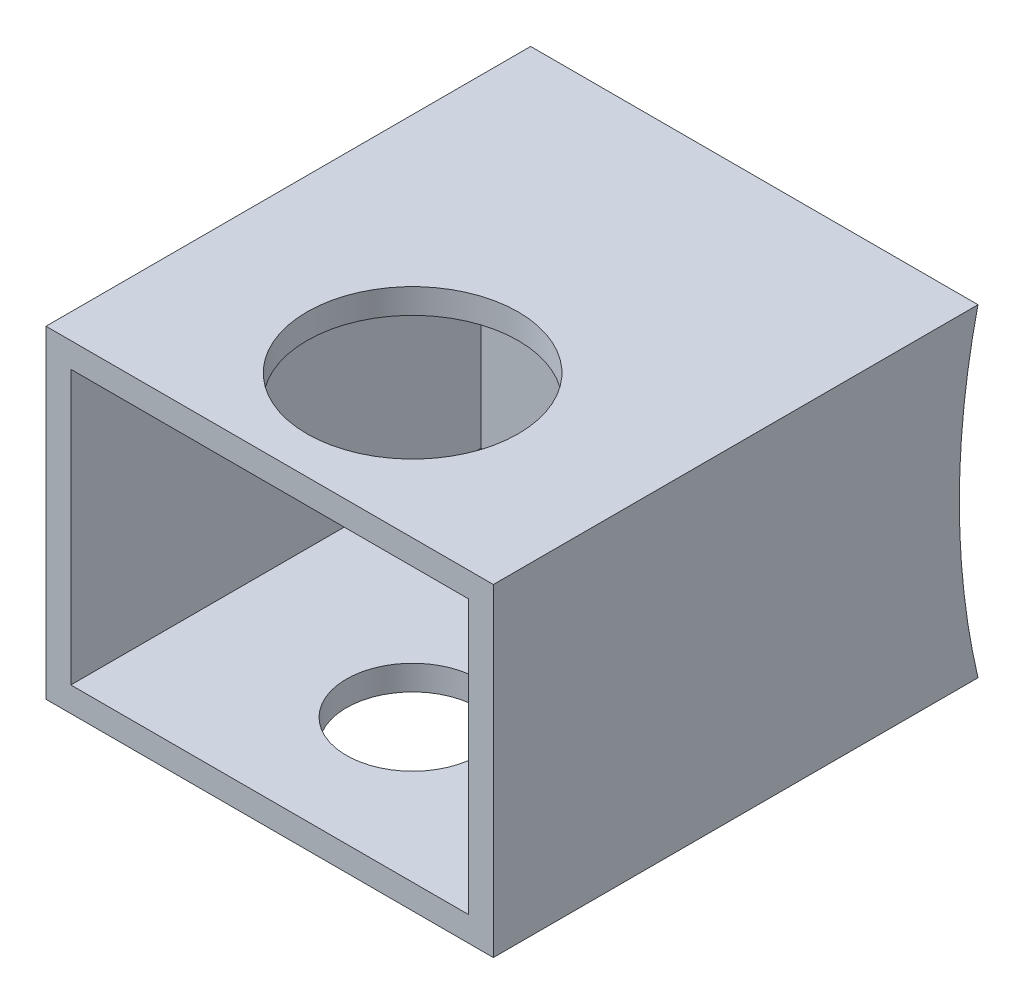
ISO-10303-21;
HEADER;
FILE_DESCRIPTION(('STEP AP214'),'2;1');
FILE_NAME('part.step','',(''),(''),'','','');
FILE_SCHEMA(('AUTOMOTIVE_DESIGN { 1 0 10303 214 1 1 1 1 }'));
ENDSEC;
DATA;
#1=APPLICATION_CONTEXT('core data for automotive mechanical design processes');
#2=APPLICATION_PROTOCOL_DEFINITION('international standard','automotive_design',2000,#1);
#3=PRODUCT_CONTEXT('',#1,'mechanical');
#4=PRODUCT('Part','Part','',(#3));
#5=PRODUCT_RELATED_PRODUCT_CATEGORY('part','',(#4));
#6=PRODUCT_DEFINITION_FORMATION('','',#4);
#7=PRODUCT_DEFINITION_CONTEXT('part definition',#1,'design');
#8=PRODUCT_DEFINITION('design','',#6,#7);
#9=PRODUCT_DEFINITION_SHAPE('','',#8);
#10=(LENGTH_UNIT() NAMED_UNIT(*) SI_UNIT(.MILLI.,.METRE.));
#11=(NAMED_UNIT(*) PLANE_ANGLE_UNIT() SI_UNIT($,.RADIAN.));
#12=(NAMED_UNIT(*) SI_UNIT($,.STERADIAN.) SOLID_ANGLE_UNIT());
#13=UNCERTAINTY_MEASURE_WITH_UNIT(LENGTH_MEASURE(1.E-05),#10,'distance_accuracy_value','');
#14=(GEOMETRIC_REPRESENTATION_CONTEXT(3) GLOBAL_UNCERTAINTY_ASSIGNED_CONTEXT((#13)) GLOBAL_UNIT_ASSIGNED_CONTEXT((#10,
#11,#12)) REPRESENTATION_CONTEXT('',''));
#15=CARTESIAN_POINT('',(0.,0.,0.));
#16=DIRECTION('',(0.,0.,1.));
#17=DIRECTION('',(1.,0.,0.));
#18=AXIS2_PLACEMENT_3D('',#15,#16,#17);
#19=CARTESIAN_POINT('',(1.30440796139928,5.04280714285714,9.906));
#20=DIRECTION('',(0.,-1.,0.));
#21=DIRECTION('',(1.,0.,0.));
#22=AXIS2_PLACEMENT_3D('',#19,#20,#21);
#23=PLANE('',#22);
#24=CARTESIAN_POINT('',(-3.26759203860072,5.04280714285714,6.985));
#25=DIRECTION('',(0.,1.,0.));
#26=DIRECTION('',(-1.,0.,0.));
#27=AXIS2_PLACEMENT_3D('',#24,#25,#26);
#28=CIRCLE('',#27,2.159);
#29=CARTESIAN_POINT('',(-5.42659203860072,5.04280714285714,6.985));
#30=VERTEX_POINT('',#29);
#31=EDGE_CURVE('E197',#30,#30,#28,.T.);
#32=ORIENTED_EDGE('',*,*,#31,.F.);
#33=EDGE_LOOP('',(#32));
#34=FACE_BOUND('',#33,.T.);
#35=DIRECTION('',(-1.,0.,0.));
#36=VECTOR('',#35,1.);
#37=CARTESIAN_POINT('',(1.30440796139928,5.04280714285714,0.));
#38=LINE('',#37,#36);
#39=CARTESIAN_POINT('',(1.30440796139928,5.04280714285714,0.));
#40=VERTEX_POINT('',#39);
#41=CARTESIAN_POINT('',(-7.83959203860072,5.04280714285714,0.));
#42=VERTEX_POINT('',#41);
#43=EDGE_CURVE('E133',#40,#42,#38,.T.);
#44=ORIENTED_EDGE('',*,*,#43,.T.);
#45=DIRECTION('',(0.,0.,-1.));
#46=VECTOR('',#45,1.);
#47=CARTESIAN_POINT('',(-7.83959203860072,5.04280714285714,9.906));
#48=LINE('',#47,#46);
#49=CARTESIAN_POINT('',(-7.83959203860072,5.04280714285714,9.906));
#50=VERTEX_POINT('',#49);
#51=EDGE_CURVE('E11',#50,#42,#48,.T.);
#52=ORIENTED_EDGE('',*,*,#51,.F.);
#53=DIRECTION('',(-1.,0.,0.));
#54=VECTOR('',#53,1.);
#55=CARTESIAN_POINT('',(1.30440796139928,5.04280714285714,9.906));
#56=LINE('',#55,#54);
#57=CARTESIAN_POINT('',(1.30440796139928,5.04280714285714,9.906));
#58=VERTEX_POINT('',#57);
#59=EDGE_CURVE('E110',#58,#50,#56,.T.);
#60=ORIENTED_EDGE('',*,*,#59,.F.);
#61=DIRECTION('',(0.,0.,-1.));
#62=VECTOR('',#61,1.);
#63=CARTESIAN_POINT('',(1.30440796139928,5.04280714285714,9.906));
#64=LINE('',#63,#62);
#65=EDGE_CURVE('E129',#58,#40,#64,.T.);
#66=ORIENTED_EDGE('',*,*,#65,.T.);
#67=EDGE_LOOP('',(#44,#52,#60,#66));
#68=FACE_BOUND('',#67,.T.);
#69=ADVANCED_FACE('F39',(#34,#68),#23,.F.);
#70=CARTESIAN_POINT('',(-7.83959203860072,5.04280714285714,9.906));
#71=DIRECTION('',(1.,0.,0.));
#72=DIRECTION('',(0.,1.,0.));
#73=AXIS2_PLACEMENT_3D('',#70,#71,#72);
#74=PLANE('',#73);
#75=ORIENTED_EDGE('',*,*,#51,.T.);
#76=CARTESIAN_POINT('',(-7.83959203860072,1.74080714285714,-14.0964279163198));
#77=DIRECTION('',(-1.,0.,0.));
#78=DIRECTION('',(0.,0.,1.));
#79=AXIS2_PLACEMENT_3D('',#76,#77,#78);
#80=CIRCLE('',#79,14.478);
#81=CARTESIAN_POINT('',(-7.83959203860072,-1.56119285714286,0.));
#82=VERTEX_POINT('',#81);
#83=EDGE_CURVE('E120',#82,#42,#80,.T.);
#84=ORIENTED_EDGE('',*,*,#83,.F.);
#85=DIRECTION('',(0.,0.,-1.));
#86=VECTOR('',#85,1.);
#87=CARTESIAN_POINT('',(-7.83959203860072,-1.56119285714286,9.906));
#88=LINE('',#87,#86);
#89=CARTESIAN_POINT('',(-7.83959203860072,-1.56119285714286,9.906));
#90=VERTEX_POINT('',#89);
#91=EDGE_CURVE('E47',#90,#82,#88,.T.);
#92=ORIENTED_EDGE('',*,*,#91,.F.);
#93=DIRECTION('',(0.,-1.,0.));
#94=VECTOR('',#93,1.);
#95=CARTESIAN_POINT('',(-7.83959203860072,5.04280714285714,9.906));
#96=LINE('',#95,#94);
#97=EDGE_CURVE('E103',#50,#90,#96,.T.);
#98=ORIENTED_EDGE('',*,*,#97,.F.);
#99=EDGE_LOOP('',(#75,#84,#92,#98));
#100=FACE_BOUND('',#99,.T.);
#101=ADVANCED_FACE('F117',(#100),#74,.F.);
#102=CARTESIAN_POINT('',(-7.83959203860072,-1.56119285714286,9.906));
#103=DIRECTION('',(0.,1.,0.));
#104=DIRECTION('',(0.,0.,1.));
#105=AXIS2_PLACEMENT_3D('',#102,#103,#104);
#106=PLANE('',#105);
#107=CARTESIAN_POINT('',(-3.26759203860072,-1.56119285714286,6.985));
#108=DIRECTION('',(0.,-1.,0.));
#109=DIRECTION('',(0.,0.,-1.));
#110=AXIS2_PLACEMENT_3D('',#107,#108,#109);
#111=CIRCLE('',#110,1.35254999999999);
#112=CARTESIAN_POINT('',(-3.26759203860072,-1.56119285714286,5.63245000000001));
#113=VERTEX_POINT('',#112);
#114=EDGE_CURVE('E205',#113,#113,#111,.T.);
#115=ORIENTED_EDGE('',*,*,#114,.F.);
#116=EDGE_LOOP('',(#115));
#117=FACE_BOUND('',#116,.T.);
#118=DIRECTION('',(1.,0.,0.));
#119=VECTOR('',#118,1.);
#120=CARTESIAN_POINT('',(-7.83959203860072,-1.56119285714286,0.));
#121=LINE('',#120,#119);
#122=CARTESIAN_POINT('',(1.30440796139928,-1.56119285714286,0.));
#123=VERTEX_POINT('',#122);
#124=EDGE_CURVE('E137',#82,#123,#121,.T.);
#125=ORIENTED_EDGE('',*,*,#124,.T.);
#126=DIRECTION('',(0.,0.,-1.));
#127=VECTOR('',#126,1.);
#128=CARTESIAN_POINT('',(1.30440796139928,-1.56119285714286,9.906));
#129=LINE('',#128,#127);
#130=CARTESIAN_POINT('',(1.30440796139928,-1.56119285714286,9.906));
#131=VERTEX_POINT('',#130);
#132=EDGE_CURVE('E123',#131,#123,#129,.T.);
#133=ORIENTED_EDGE('',*,*,#132,.F.);
#134=DIRECTION('',(1.,0.,0.));
#135=VECTOR('',#134,1.);
#136=CARTESIAN_POINT('',(-7.83959203860072,-1.56119285714286,9.906));
#137=LINE('',#136,#135);
#138=EDGE_CURVE('E107',#90,#131,#137,.T.);
#139=ORIENTED_EDGE('',*,*,#138,.F.);
#140=ORIENTED_EDGE('',*,*,#91,.T.);
#141=EDGE_LOOP('',(#125,#133,#139,#140));
#142=FACE_BOUND('',#141,.T.);
#143=ADVANCED_FACE('F124',(#117,#142),#106,.F.);
#144=CARTESIAN_POINT('',(1.30440796139928,-1.56119285714286,9.906));
#145=DIRECTION('',(-1.,0.,0.));
#146=DIRECTION('',(0.,0.,1.));
#147=AXIS2_PLACEMENT_3D('',#144,#145,#146);
#148=PLANE('',#147);
#149=ORIENTED_EDGE('',*,*,#132,.T.);
#150=CARTESIAN_POINT('',(1.30440796139928,1.74080714285714,-14.0964279163198));
#151=DIRECTION('',(-1.,0.,0.));
#152=DIRECTION('',(0.,0.,1.));
#153=AXIS2_PLACEMENT_3D('',#150,#151,#152);
#154=CIRCLE('',#153,14.478);
#155=EDGE_CURVE('E76',#123,#40,#154,.T.);
#156=ORIENTED_EDGE('',*,*,#155,.T.);
#157=ORIENTED_EDGE('',*,*,#65,.F.);
#158=DIRECTION('',(0.,1.,0.));
#159=VECTOR('',#158,1.);
#160=CARTESIAN_POINT('',(1.30440796139928,-1.56119285714286,9.906));
#161=LINE('',#160,#159);
#162=EDGE_CURVE('E63',#131,#58,#161,.T.);
#163=ORIENTED_EDGE('',*,*,#162,.F.);
#164=EDGE_LOOP('',(#149,#156,#157,#163));
#165=FACE_BOUND('',#164,.T.);
#166=ADVANCED_FACE('F145',(#165),#148,.F.);
#167=CARTESIAN_POINT('',(0.,0.,9.906));
#168=DIRECTION('',(0.,0.,1.));
#169=DIRECTION('',(1.,0.,0.));
#170=AXIS2_PLACEMENT_3D('',#167,#168,#169);
#171=PLANE('',#170);
#172=DIRECTION('',(-1.,0.,0.));
#173=VECTOR('',#172,1.);
#174=CARTESIAN_POINT('',(0.79640796139928,4.53480714285714,9.906));
#175=LINE('',#174,#173);
#176=CARTESIAN_POINT('',(0.79640796139928,4.53480714285714,9.906));
#177=VERTEX_POINT('',#176);
#178=CARTESIAN_POINT('',(-7.33159203860072,4.53480714285714,9.906));
#179=VERTEX_POINT('',#178);
#180=EDGE_CURVE('E54',#177,#179,#175,.T.);
#181=ORIENTED_EDGE('',*,*,#180,.F.);
#182=DIRECTION('',(0.,1.,0.));
#183=VECTOR('',#182,1.);
#184=CARTESIAN_POINT('',(0.79640796139928,-1.05319285714286,9.906));
#185=LINE('',#184,#183);
#186=CARTESIAN_POINT('',(0.79640796139928,-1.05319285714286,9.906));
#187=VERTEX_POINT('',#186);
#188=EDGE_CURVE('E161',#187,#177,#185,.T.);
#189=ORIENTED_EDGE('',*,*,#188,.F.);
#190=DIRECTION('',(1.,0.,0.));
#191=VECTOR('',#190,1.);
#192=CARTESIAN_POINT('',(-7.33159203860072,-1.05319285714286,9.906));
#193=LINE('',#192,#191);
#194=CARTESIAN_POINT('',(-7.33159203860072,-1.05319285714286,9.906));
#195=VERTEX_POINT('',#194);
#196=EDGE_CURVE('E165',#195,#187,#193,.T.);
#197=ORIENTED_EDGE('',*,*,#196,.F.);
#198=DIRECTION('',(0.,-1.,0.));
#199=VECTOR('',#198,1.);
#200=CARTESIAN_POINT('',(-7.33159203860072,4.53480714285714,9.906));
#201=LINE('',#200,#199);
#202=EDGE_CURVE('E169',#179,#195,#201,.T.);
#203=ORIENTED_EDGE('',*,*,#202,.F.);
#204=EDGE_LOOP('',(#181,#189,#197,#203));
#205=FACE_BOUND('',#204,.T.);
#206=ORIENTED_EDGE('',*,*,#59,.T.);
#207=ORIENTED_EDGE('',*,*,#97,.T.);
#208=ORIENTED_EDGE('',*,*,#138,.T.);
#209=ORIENTED_EDGE('',*,*,#162,.T.);
#210=EDGE_LOOP('',(#206,#207,#208,#209));
#211=FACE_BOUND('',#210,.T.);
#212=ADVANCED_FACE('F105',(#205,#211),#171,.T.);
#213=CARTESIAN_POINT('',(0.79640796139928,4.53480714285714,1.524));
#214=DIRECTION('',(0.,1.,0.));
#215=DIRECTION('',(-1.,0.,0.));
#216=AXIS2_PLACEMENT_3D('',#213,#214,#215);
#217=PLANE('',#216);
#218=CARTESIAN_POINT('',(-3.26759203860072,4.53480714285714,6.985));
#219=DIRECTION('',(0.,1.,0.));
#220=DIRECTION('',(-1.,0.,0.));
#221=AXIS2_PLACEMENT_3D('',#218,#219,#220);
#222=CIRCLE('',#221,2.159);
#223=CARTESIAN_POINT('',(-5.42659203860072,4.53480714285714,6.985));
#224=VERTEX_POINT('',#223);
#225=EDGE_CURVE('E191',#224,#224,#222,.F.);
#226=ORIENTED_EDGE('',*,*,#225,.F.);
#227=EDGE_LOOP('',(#226));
#228=FACE_BOUND('',#227,.T.);
#229=ORIENTED_EDGE('',*,*,#180,.T.);
#230=DIRECTION('',(0.,0.,1.));
#231=VECTOR('',#230,1.);
#232=CARTESIAN_POINT('',(-7.33159203860072,4.53480714285714,1.524));
#233=LINE('',#232,#231);
#234=CARTESIAN_POINT('',(-7.33159203860072,4.53480714285714,1.524));
#235=VERTEX_POINT('',#234);
#236=EDGE_CURVE('E149',#235,#179,#233,.T.);
#237=ORIENTED_EDGE('',*,*,#236,.F.);
#238=DIRECTION('',(-1.,0.,0.));
#239=VECTOR('',#238,1.);
#240=CARTESIAN_POINT('',(0.79640796139928,4.53480714285714,1.524));
#241=LINE('',#240,#239);
#242=CARTESIAN_POINT('',(0.79640796139928,4.53480714285714,1.524));
#243=VERTEX_POINT('',#242);
#244=EDGE_CURVE('E164',#243,#235,#241,.T.);
#245=ORIENTED_EDGE('',*,*,#244,.F.);
#246=DIRECTION('',(0.,0.,1.));
#247=VECTOR('',#246,1.);
#248=CARTESIAN_POINT('',(0.79640796139928,4.53480714285714,1.524));
#249=LINE('',#248,#247);
#250=EDGE_CURVE('E86',#243,#177,#249,.T.);
#251=ORIENTED_EDGE('',*,*,#250,.T.);
#252=EDGE_LOOP('',(#229,#237,#245,#251));
#253=FACE_BOUND('',#252,.T.);
#254=ADVANCED_FACE('F232',(#228,#253),#217,.F.);
#255=CARTESIAN_POINT('',(0.79640796139928,-1.05319285714286,1.524));
#256=DIRECTION('',(1.,0.,0.));
#257=DIRECTION('',(0.,0.,-1.));
#258=AXIS2_PLACEMENT_3D('',#255,#256,#257);
#259=PLANE('',#258);
#260=ORIENTED_EDGE('',*,*,#188,.T.);
#261=ORIENTED_EDGE('',*,*,#250,.F.);
#262=DIRECTION('',(0.,1.,0.));
#263=VECTOR('',#262,1.);
#264=CARTESIAN_POINT('',(0.79640796139928,-1.05319285714286,1.524));
#265=LINE('',#264,#263);
#266=CARTESIAN_POINT('',(0.79640796139928,-1.05319285714286,1.524));
#267=VERTEX_POINT('',#266);
#268=EDGE_CURVE('E153',#267,#243,#265,.T.);
#269=ORIENTED_EDGE('',*,*,#268,.F.);
#270=DIRECTION('',(0.,0.,1.));
#271=VECTOR('',#270,1.);
#272=CARTESIAN_POINT('',(0.79640796139928,-1.05319285714286,1.524));
#273=LINE('',#272,#271);
#274=EDGE_CURVE('E156',#267,#187,#273,.T.);
#275=ORIENTED_EDGE('',*,*,#274,.T.);
#276=EDGE_LOOP('',(#260,#261,#269,#275));
#277=FACE_BOUND('',#276,.T.);
#278=ADVANCED_FACE('F234',(#277),#259,.F.);
#279=CARTESIAN_POINT('',(-7.33159203860072,-1.05319285714286,1.524));
#280=DIRECTION('',(0.,-1.,0.));
#281=DIRECTION('',(0.,0.,-1.));
#282=AXIS2_PLACEMENT_3D('',#279,#280,#281);
#283=PLANE('',#282);
#284=CARTESIAN_POINT('',(-3.26759203860072,-1.05319285714286,6.985));
#285=DIRECTION('',(0.,-1.,0.));
#286=DIRECTION('',(0.,0.,-1.));
#287=AXIS2_PLACEMENT_3D('',#284,#285,#286);
#288=CIRCLE('',#287,1.35254999999999);
#289=CARTESIAN_POINT('',(-3.26759203860072,-1.05319285714286,5.63245000000001));
#290=VERTEX_POINT('',#289);
#291=EDGE_CURVE('E201',#290,#290,#288,.T.);
#292=ORIENTED_EDGE('',*,*,#291,.T.);
#293=EDGE_LOOP('',(#292));
#294=FACE_BOUND('',#293,.T.);
#295=ORIENTED_EDGE('',*,*,#196,.T.);
#296=ORIENTED_EDGE('',*,*,#274,.F.);
#297=DIRECTION('',(1.,0.,0.));
#298=VECTOR('',#297,1.);
#299=CARTESIAN_POINT('',(-7.33159203860072,-1.05319285714286,1.524));
#300=LINE('',#299,#298);
#301=CARTESIAN_POINT('',(-7.33159203860072,-1.05319285714286,1.524));
#302=VERTEX_POINT('',#301);
#303=EDGE_CURVE('E178',#302,#267,#300,.T.);
#304=ORIENTED_EDGE('',*,*,#303,.F.);
#305=DIRECTION('',(0.,0.,1.));
#306=VECTOR('',#305,1.);
#307=CARTESIAN_POINT('',(-7.33159203860072,-1.05319285714286,1.524));
#308=LINE('',#307,#306);
#309=EDGE_CURVE('E152',#302,#195,#308,.T.);
#310=ORIENTED_EDGE('',*,*,#309,.T.);
#311=EDGE_LOOP('',(#295,#296,#304,#310));
#312=FACE_BOUND('',#311,.T.);
#313=ADVANCED_FACE('F240',(#294,#312),#283,.F.);
#314=CARTESIAN_POINT('',(-7.33159203860072,4.53480714285714,1.524));
#315=DIRECTION('',(-1.,0.,0.));
#316=DIRECTION('',(0.,-1.,0.));
#317=AXIS2_PLACEMENT_3D('',#314,#315,#316);
#318=PLANE('',#317);
#319=ORIENTED_EDGE('',*,*,#202,.T.);
#320=ORIENTED_EDGE('',*,*,#309,.F.);
#321=DIRECTION('',(0.,-1.,0.));
#322=VECTOR('',#321,1.);
#323=CARTESIAN_POINT('',(-7.33159203860072,4.53480714285714,1.524));
#324=LINE('',#323,#322);
#325=EDGE_CURVE('E182',#235,#302,#324,.T.);
#326=ORIENTED_EDGE('',*,*,#325,.F.);
#327=ORIENTED_EDGE('',*,*,#236,.T.);
#328=EDGE_LOOP('',(#319,#320,#326,#327));
#329=FACE_BOUND('',#328,.T.);
#330=ADVANCED_FACE('F245',(#329),#318,.F.);
#331=CARTESIAN_POINT('',(0.,0.,1.524));
#332=DIRECTION('',(0.,0.,1.));
#333=DIRECTION('',(1.,0.,0.));
#334=AXIS2_PLACEMENT_3D('',#331,#332,#333);
#335=PLANE('',#334);
#336=ORIENTED_EDGE('',*,*,#244,.T.);
#337=ORIENTED_EDGE('',*,*,#325,.T.);
#338=ORIENTED_EDGE('',*,*,#303,.T.);
#339=ORIENTED_EDGE('',*,*,#268,.T.);
#340=EDGE_LOOP('',(#336,#337,#338,#339));
#341=FACE_BOUND('',#340,.T.);
#342=ADVANCED_FACE('F248',(#341),#335,.T.);
#343=CARTESIAN_POINT('',(1.30440796139928,1.74080714285714,-14.0964279163198));
#344=DIRECTION('',(-1.,0.,0.));
#345=DIRECTION('',(0.,0.,1.));
#346=AXIS2_PLACEMENT_3D('',#343,#344,#345);
#347=CYLINDRICAL_SURFACE('',#346,14.478);
#348=ORIENTED_EDGE('',*,*,#83,.T.);
#349=ORIENTED_EDGE('',*,*,#43,.F.);
#350=ORIENTED_EDGE('',*,*,#155,.F.);
#351=ORIENTED_EDGE('',*,*,#124,.F.);
#352=EDGE_LOOP('',(#348,#349,#350,#351));
#353=FACE_BOUND('',#352,.T.);
#354=ADVANCED_FACE('F228',(#353),#347,.F.);
#355=CARTESIAN_POINT('',(-3.26759203860072,-1.56219285714286,6.985));
#356=DIRECTION('',(0.,1.,0.));
#357=DIRECTION('',(-1.,0.,0.));
#358=AXIS2_PLACEMENT_3D('',#355,#356,#357);
#359=CYLINDRICAL_SURFACE('',#358,2.159);
#360=ORIENTED_EDGE('',*,*,#31,.T.);
#361=EDGE_LOOP('',(#360));
#362=FACE_BOUND('',#361,.T.);
#363=ORIENTED_EDGE('',*,*,#225,.T.);
#364=EDGE_LOOP('',(#363));
#365=FACE_BOUND('',#364,.T.);
#366=ADVANCED_FACE('F225',(#362,#365),#359,.F.);
#367=CARTESIAN_POINT('',(-3.26759203860072,-1.56119285714286,6.985));
#368=DIRECTION('',(0.,-1.,0.));
#369=DIRECTION('',(0.,0.,-1.));
#370=AXIS2_PLACEMENT_3D('',#367,#368,#369);
#371=CYLINDRICAL_SURFACE('',#370,1.35254999999999);
#372=ORIENTED_EDGE('',*,*,#291,.F.);
#373=EDGE_LOOP('',(#372));
#374=FACE_BOUND('',#373,.T.);
#375=ORIENTED_EDGE('',*,*,#114,.T.);
#376=EDGE_LOOP('',(#375));
#377=FACE_BOUND('',#376,.T.);
#378=ADVANCED_FACE('F210',(#374,#377),#371,.F.);
#379=CLOSED_SHELL('',(#69,#101,#143,#166,#212,#254,#278,#313,#330,#342,#354,#366,#378));
#380=MANIFOLD_SOLID_BREP('B2',#379);
#381=ADVANCED_BREP_SHAPE_REPRESENTATION('',(#18,#380),#14);
#382=SHAPE_DEFINITION_REPRESENTATION(#9,#381);
ENDSEC;
END-ISO-10303-21;
